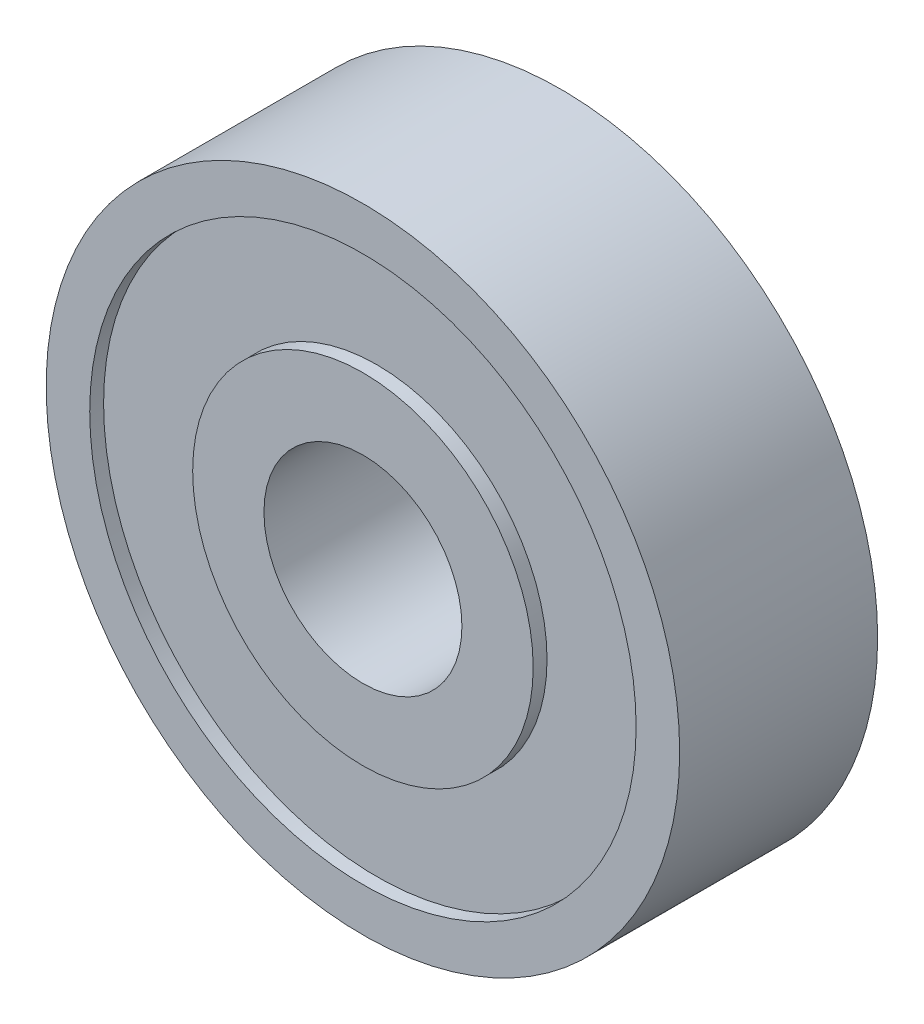
ISO-10303-21;
HEADER;
FILE_DESCRIPTION(('STEP AP214'),'2;1');
FILE_NAME('part.step','',(''),(''),'','','');
FILE_SCHEMA(('AUTOMOTIVE_DESIGN { 1 0 10303 214 1 1 1 1 }'));
ENDSEC;
DATA;
#1=APPLICATION_CONTEXT('core data for automotive mechanical design processes');
#2=APPLICATION_PROTOCOL_DEFINITION('international standard','automotive_design',2000,#1);
#3=PRODUCT_CONTEXT('',#1,'mechanical');
#4=PRODUCT('Part','Part','',(#3));
#5=PRODUCT_RELATED_PRODUCT_CATEGORY('part','',(#4));
#6=PRODUCT_DEFINITION_FORMATION('','',#4);
#7=PRODUCT_DEFINITION_CONTEXT('part definition',#1,'design');
#8=PRODUCT_DEFINITION('design','',#6,#7);
#9=PRODUCT_DEFINITION_SHAPE('','',#8);
#10=(LENGTH_UNIT() NAMED_UNIT(*) SI_UNIT(.MILLI.,.METRE.));
#11=(NAMED_UNIT(*) PLANE_ANGLE_UNIT() SI_UNIT($,.RADIAN.));
#12=(NAMED_UNIT(*) SI_UNIT($,.STERADIAN.) SOLID_ANGLE_UNIT());
#13=UNCERTAINTY_MEASURE_WITH_UNIT(LENGTH_MEASURE(1.E-05),#10,'distance_accuracy_value','');
#14=(GEOMETRIC_REPRESENTATION_CONTEXT(3) GLOBAL_UNCERTAINTY_ASSIGNED_CONTEXT((#13)) GLOBAL_UNIT_ASSIGNED_CONTEXT((#10,
#11,#12)) REPRESENTATION_CONTEXT('',''));
#15=CARTESIAN_POINT('',(0.,0.,0.));
#16=DIRECTION('',(0.,0.,1.));
#17=DIRECTION('',(1.,0.,0.));
#18=AXIS2_PLACEMENT_3D('',#15,#16,#17);
#19=CARTESIAN_POINT('',(0.,8.,-2.5));
#20=DIRECTION('',(0.,0.,1.));
#21=DIRECTION('',(1.,0.,0.));
#22=AXIS2_PLACEMENT_3D('',#19,#20,#21);
#23=PLANE('',#22);
#24=CARTESIAN_POINT('',(0.,0.,-2.5));
#25=DIRECTION('',(0.,0.,1.));
#26=DIRECTION('',(1.,0.,0.));
#27=AXIS2_PLACEMENT_3D('',#24,#25,#26);
#28=CIRCLE('',#27,8.);
#29=CARTESIAN_POINT('',(8.,0.,-2.5));
#30=VERTEX_POINT('',#29);
#31=EDGE_CURVE('E54',#30,#30,#28,.T.);
#32=ORIENTED_EDGE('',*,*,#31,.F.);
#33=EDGE_LOOP('',(#32));
#34=FACE_BOUND('',#33,.T.);
#35=CARTESIAN_POINT('',(0.,0.,-2.5));
#36=DIRECTION('',(0.,0.,1.));
#37=DIRECTION('',(1.,0.,0.));
#38=AXIS2_PLACEMENT_3D('',#35,#36,#37);
#39=CIRCLE('',#38,6.9);
#40=CARTESIAN_POINT('',(6.9,0.,-2.5));
#41=VERTEX_POINT('',#40);
#42=EDGE_CURVE('E9',#41,#41,#39,.T.);
#43=ORIENTED_EDGE('',*,*,#42,.T.);
#44=EDGE_LOOP('',(#43));
#45=FACE_BOUND('',#44,.T.);
#46=ADVANCED_FACE('F14',(#34,#45),#23,.F.);
#47=CARTESIAN_POINT('',(0.,0.,12.0286738351254));
#48=DIRECTION('',(0.,0.,1.));
#49=DIRECTION('',(1.,0.,0.));
#50=AXIS2_PLACEMENT_3D('',#47,#48,#49);
#51=CYLINDRICAL_SURFACE('',#50,6.9);
#52=ORIENTED_EDGE('',*,*,#42,.F.);
#53=EDGE_LOOP('',(#52));
#54=FACE_BOUND('',#53,.T.);
#55=CARTESIAN_POINT('',(0.,0.,-2.15));
#56=DIRECTION('',(0.,0.,1.));
#57=DIRECTION('',(1.,0.,0.));
#58=AXIS2_PLACEMENT_3D('',#55,#56,#57);
#59=CIRCLE('',#58,6.9);
#60=CARTESIAN_POINT('',(6.9,0.,-2.15));
#61=VERTEX_POINT('',#60);
#62=EDGE_CURVE('E20',#61,#61,#59,.T.);
#63=ORIENTED_EDGE('',*,*,#62,.T.);
#64=EDGE_LOOP('',(#63));
#65=FACE_BOUND('',#64,.T.);
#66=ADVANCED_FACE('F61',(#54,#65),#51,.F.);
#67=CARTESIAN_POINT('',(0.,6.9,-2.15));
#68=DIRECTION('',(0.,0.,1.));
#69=DIRECTION('',(1.,0.,0.));
#70=AXIS2_PLACEMENT_3D('',#67,#68,#69);
#71=PLANE('',#70);
#72=ORIENTED_EDGE('',*,*,#62,.F.);
#73=EDGE_LOOP('',(#72));
#74=FACE_BOUND('',#73,.T.);
#75=CARTESIAN_POINT('',(0.,0.,-2.15));
#76=DIRECTION('',(0.,0.,1.));
#77=DIRECTION('',(1.,0.,0.));
#78=AXIS2_PLACEMENT_3D('',#75,#76,#77);
#79=CIRCLE('',#78,4.3);
#80=CARTESIAN_POINT('',(4.3,0.,-2.15));
#81=VERTEX_POINT('',#80);
#82=EDGE_CURVE('E24',#81,#81,#79,.T.);
#83=ORIENTED_EDGE('',*,*,#82,.T.);
#84=EDGE_LOOP('',(#83));
#85=FACE_BOUND('',#84,.T.);
#86=ADVANCED_FACE('F66',(#74,#85),#71,.F.);
#87=CARTESIAN_POINT('',(0.,0.,12.0286738351254));
#88=DIRECTION('',(0.,0.,1.));
#89=DIRECTION('',(1.,0.,0.));
#90=AXIS2_PLACEMENT_3D('',#87,#88,#89);
#91=CYLINDRICAL_SURFACE('',#90,4.3);
#92=ORIENTED_EDGE('',*,*,#82,.F.);
#93=EDGE_LOOP('',(#92));
#94=FACE_BOUND('',#93,.T.);
#95=CARTESIAN_POINT('',(0.,0.,-2.5));
#96=DIRECTION('',(0.,0.,1.));
#97=DIRECTION('',(1.,0.,0.));
#98=AXIS2_PLACEMENT_3D('',#95,#96,#97);
#99=CIRCLE('',#98,4.3);
#100=CARTESIAN_POINT('',(4.3,0.,-2.5));
#101=VERTEX_POINT('',#100);
#102=EDGE_CURVE('E28',#101,#101,#99,.T.);
#103=ORIENTED_EDGE('',*,*,#102,.T.);
#104=EDGE_LOOP('',(#103));
#105=FACE_BOUND('',#104,.T.);
#106=ADVANCED_FACE('F71',(#94,#105),#91,.T.);
#107=CARTESIAN_POINT('',(0.,4.3,-2.5));
#108=DIRECTION('',(0.,0.,1.));
#109=DIRECTION('',(1.,0.,0.));
#110=AXIS2_PLACEMENT_3D('',#107,#108,#109);
#111=PLANE('',#110);
#112=ORIENTED_EDGE('',*,*,#102,.F.);
#113=EDGE_LOOP('',(#112));
#114=FACE_BOUND('',#113,.T.);
#115=CARTESIAN_POINT('',(0.,0.,-2.5));
#116=DIRECTION('',(0.,0.,1.));
#117=DIRECTION('',(1.,0.,0.));
#118=AXIS2_PLACEMENT_3D('',#115,#116,#117);
#119=CIRCLE('',#118,2.5);
#120=CARTESIAN_POINT('',(2.5,0.,-2.5));
#121=VERTEX_POINT('',#120);
#122=EDGE_CURVE('E33',#121,#121,#119,.T.);
#123=ORIENTED_EDGE('',*,*,#122,.T.);
#124=EDGE_LOOP('',(#123));
#125=FACE_BOUND('',#124,.T.);
#126=ADVANCED_FACE('F77',(#114,#125),#111,.F.);
#127=CARTESIAN_POINT('',(0.,0.,12.0286738351254));
#128=DIRECTION('',(0.,0.,1.));
#129=DIRECTION('',(1.,0.,0.));
#130=AXIS2_PLACEMENT_3D('',#127,#128,#129);
#131=CYLINDRICAL_SURFACE('',#130,2.5);
#132=ORIENTED_EDGE('',*,*,#122,.F.);
#133=EDGE_LOOP('',(#132));
#134=FACE_BOUND('',#133,.T.);
#135=CARTESIAN_POINT('',(0.,0.,2.5));
#136=DIRECTION('',(0.,0.,1.));
#137=DIRECTION('',(1.,0.,0.));
#138=AXIS2_PLACEMENT_3D('',#135,#136,#137);
#139=CIRCLE('',#138,2.5);
#140=CARTESIAN_POINT('',(2.5,0.,2.5));
#141=VERTEX_POINT('',#140);
#142=EDGE_CURVE('E36',#141,#141,#139,.T.);
#143=ORIENTED_EDGE('',*,*,#142,.T.);
#144=EDGE_LOOP('',(#143));
#145=FACE_BOUND('',#144,.T.);
#146=ADVANCED_FACE('F81',(#134,#145),#131,.F.);
#147=CARTESIAN_POINT('',(0.,4.3,2.5));
#148=DIRECTION('',(0.,0.,-1.));
#149=DIRECTION('',(-1.,0.,0.));
#150=AXIS2_PLACEMENT_3D('',#147,#148,#149);
#151=PLANE('',#150);
#152=ORIENTED_EDGE('',*,*,#142,.F.);
#153=EDGE_LOOP('',(#152));
#154=FACE_BOUND('',#153,.T.);
#155=CARTESIAN_POINT('',(0.,0.,2.5));
#156=DIRECTION('',(0.,0.,1.));
#157=DIRECTION('',(1.,0.,0.));
#158=AXIS2_PLACEMENT_3D('',#155,#156,#157);
#159=CIRCLE('',#158,4.3);
#160=CARTESIAN_POINT('',(4.3,0.,2.5));
#161=VERTEX_POINT('',#160);
#162=EDGE_CURVE('E39',#161,#161,#159,.T.);
#163=ORIENTED_EDGE('',*,*,#162,.T.);
#164=EDGE_LOOP('',(#163));
#165=FACE_BOUND('',#164,.T.);
#166=ADVANCED_FACE('F85',(#154,#165),#151,.F.);
#167=CARTESIAN_POINT('',(0.,0.,12.0286738351254));
#168=DIRECTION('',(0.,0.,1.));
#169=DIRECTION('',(1.,0.,0.));
#170=AXIS2_PLACEMENT_3D('',#167,#168,#169);
#171=CYLINDRICAL_SURFACE('',#170,4.3);
#172=ORIENTED_EDGE('',*,*,#162,.F.);
#173=EDGE_LOOP('',(#172));
#174=FACE_BOUND('',#173,.T.);
#175=CARTESIAN_POINT('',(0.,0.,2.15));
#176=DIRECTION('',(0.,0.,1.));
#177=DIRECTION('',(1.,0.,0.));
#178=AXIS2_PLACEMENT_3D('',#175,#176,#177);
#179=CIRCLE('',#178,4.3);
#180=CARTESIAN_POINT('',(4.3,0.,2.15));
#181=VERTEX_POINT('',#180);
#182=EDGE_CURVE('E42',#181,#181,#179,.T.);
#183=ORIENTED_EDGE('',*,*,#182,.T.);
#184=EDGE_LOOP('',(#183));
#185=FACE_BOUND('',#184,.T.);
#186=ADVANCED_FACE('F89',(#174,#185),#171,.T.);
#187=CARTESIAN_POINT('',(0.,6.9,2.15));
#188=DIRECTION('',(0.,0.,-1.));
#189=DIRECTION('',(-1.,0.,0.));
#190=AXIS2_PLACEMENT_3D('',#187,#188,#189);
#191=PLANE('',#190);
#192=ORIENTED_EDGE('',*,*,#182,.F.);
#193=EDGE_LOOP('',(#192));
#194=FACE_BOUND('',#193,.T.);
#195=CARTESIAN_POINT('',(0.,0.,2.15));
#196=DIRECTION('',(0.,0.,1.));
#197=DIRECTION('',(1.,0.,0.));
#198=AXIS2_PLACEMENT_3D('',#195,#196,#197);
#199=CIRCLE('',#198,6.9);
#200=CARTESIAN_POINT('',(6.9,0.,2.15));
#201=VERTEX_POINT('',#200);
#202=EDGE_CURVE('E45',#201,#201,#199,.T.);
#203=ORIENTED_EDGE('',*,*,#202,.T.);
#204=EDGE_LOOP('',(#203));
#205=FACE_BOUND('',#204,.T.);
#206=ADVANCED_FACE('F93',(#194,#205),#191,.F.);
#207=CARTESIAN_POINT('',(0.,0.,12.0286738351254));
#208=DIRECTION('',(0.,0.,1.));
#209=DIRECTION('',(1.,0.,0.));
#210=AXIS2_PLACEMENT_3D('',#207,#208,#209);
#211=CYLINDRICAL_SURFACE('',#210,6.9);
#212=ORIENTED_EDGE('',*,*,#202,.F.);
#213=EDGE_LOOP('',(#212));
#214=FACE_BOUND('',#213,.T.);
#215=CARTESIAN_POINT('',(0.,0.,2.5));
#216=DIRECTION('',(0.,0.,1.));
#217=DIRECTION('',(1.,0.,0.));
#218=AXIS2_PLACEMENT_3D('',#215,#216,#217);
#219=CIRCLE('',#218,6.9);
#220=CARTESIAN_POINT('',(6.9,0.,2.5));
#221=VERTEX_POINT('',#220);
#222=EDGE_CURVE('E48',#221,#221,#219,.T.);
#223=ORIENTED_EDGE('',*,*,#222,.T.);
#224=EDGE_LOOP('',(#223));
#225=FACE_BOUND('',#224,.T.);
#226=ADVANCED_FACE('F97',(#214,#225),#211,.F.);
#227=CARTESIAN_POINT('',(0.,8.,2.5));
#228=DIRECTION('',(0.,0.,-1.));
#229=DIRECTION('',(-1.,0.,0.));
#230=AXIS2_PLACEMENT_3D('',#227,#228,#229);
#231=PLANE('',#230);
#232=ORIENTED_EDGE('',*,*,#222,.F.);
#233=EDGE_LOOP('',(#232));
#234=FACE_BOUND('',#233,.T.);
#235=CARTESIAN_POINT('',(0.,0.,2.5));
#236=DIRECTION('',(0.,0.,1.));
#237=DIRECTION('',(1.,0.,0.));
#238=AXIS2_PLACEMENT_3D('',#235,#236,#237);
#239=CIRCLE('',#238,8.);
#240=CARTESIAN_POINT('',(8.,0.,2.5));
#241=VERTEX_POINT('',#240);
#242=EDGE_CURVE('E51',#241,#241,#239,.T.);
#243=ORIENTED_EDGE('',*,*,#242,.T.);
#244=EDGE_LOOP('',(#243));
#245=FACE_BOUND('',#244,.T.);
#246=ADVANCED_FACE('F101',(#234,#245),#231,.F.);
#247=CARTESIAN_POINT('',(0.,0.,12.0286738351254));
#248=DIRECTION('',(0.,0.,1.));
#249=DIRECTION('',(1.,0.,0.));
#250=AXIS2_PLACEMENT_3D('',#247,#248,#249);
#251=CYLINDRICAL_SURFACE('',#250,8.);
#252=ORIENTED_EDGE('',*,*,#242,.F.);
#253=EDGE_LOOP('',(#252));
#254=FACE_BOUND('',#253,.T.);
#255=ORIENTED_EDGE('',*,*,#31,.T.);
#256=EDGE_LOOP('',(#255));
#257=FACE_BOUND('',#256,.T.);
#258=ADVANCED_FACE('F58',(#254,#257),#251,.T.);
#259=CLOSED_SHELL('',(#46,#66,#86,#106,#126,#146,#166,#186,#206,#226,#246,#258));
#260=MANIFOLD_SOLID_BREP('B1',#259);
#261=ADVANCED_BREP_SHAPE_REPRESENTATION('',(#18,#260),#14);
#262=SHAPE_DEFINITION_REPRESENTATION(#9,#261);
ENDSEC;
END-ISO-10303-21;
